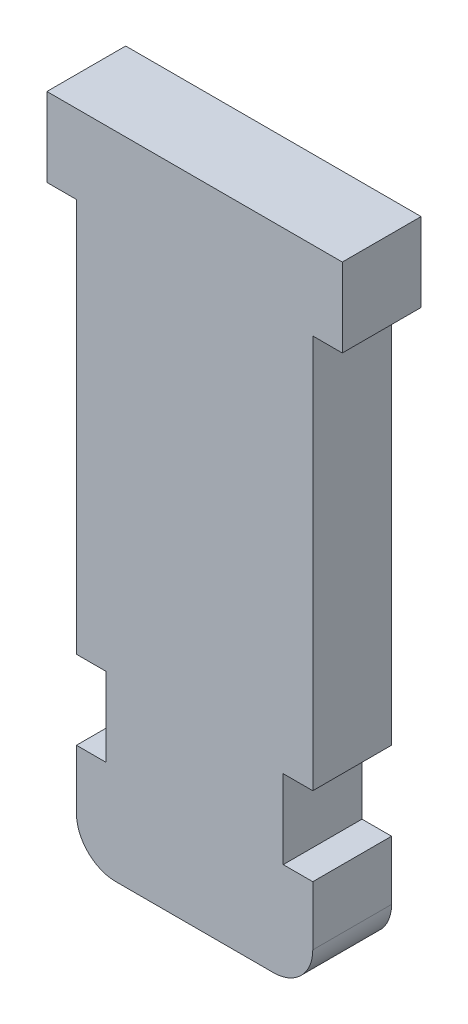
ISO-10303-21;
HEADER;
FILE_DESCRIPTION(('STEP AP214'),'2;1');
FILE_NAME('part.step','',(''),(''),'','','');
FILE_SCHEMA(('AUTOMOTIVE_DESIGN { 1 0 10303 214 1 1 1 1 }'));
ENDSEC;
DATA;
#1=APPLICATION_CONTEXT('core data for automotive mechanical design processes');
#2=APPLICATION_PROTOCOL_DEFINITION('international standard','automotive_design',2000,#1);
#3=PRODUCT_CONTEXT('',#1,'mechanical');
#4=PRODUCT('Part','Part','',(#3));
#5=PRODUCT_RELATED_PRODUCT_CATEGORY('part','',(#4));
#6=PRODUCT_DEFINITION_FORMATION('','',#4);
#7=PRODUCT_DEFINITION_CONTEXT('part definition',#1,'design');
#8=PRODUCT_DEFINITION('design','',#6,#7);
#9=PRODUCT_DEFINITION_SHAPE('','',#8);
#10=(LENGTH_UNIT() NAMED_UNIT(*) SI_UNIT(.MILLI.,.METRE.));
#11=(NAMED_UNIT(*) PLANE_ANGLE_UNIT() SI_UNIT($,.RADIAN.));
#12=(NAMED_UNIT(*) SI_UNIT($,.STERADIAN.) SOLID_ANGLE_UNIT());
#13=UNCERTAINTY_MEASURE_WITH_UNIT(LENGTH_MEASURE(1.E-05),#10,'distance_accuracy_value','');
#14=(GEOMETRIC_REPRESENTATION_CONTEXT(3) GLOBAL_UNCERTAINTY_ASSIGNED_CONTEXT((#13)) GLOBAL_UNIT_ASSIGNED_CONTEXT((#10,
#11,#12)) REPRESENTATION_CONTEXT('',''));
#15=CARTESIAN_POINT('',(0.,0.,0.));
#16=DIRECTION('',(0.,0.,1.));
#17=DIRECTION('',(1.,0.,0.));
#18=AXIS2_PLACEMENT_3D('',#15,#16,#17);
#19=CARTESIAN_POINT('',(-6.,0.,4.));
#20=DIRECTION('',(-1.,0.,0.));
#21=DIRECTION('',(0.,-1.,0.));
#22=AXIS2_PLACEMENT_3D('',#19,#20,#21);
#23=PLANE('',#22);
#24=DIRECTION('',(0.,0.,1.));
#25=VECTOR('',#24,1.);
#26=CARTESIAN_POINT('',(-6.,-22.,0.));
#27=LINE('',#26,#25);
#28=CARTESIAN_POINT('',(-6.,-22.,0.));
#29=VERTEX_POINT('',#28);
#30=CARTESIAN_POINT('',(-6.,-22.,4.));
#31=VERTEX_POINT('',#30);
#32=EDGE_CURVE('E366',#29,#31,#27,.T.);
#33=ORIENTED_EDGE('',*,*,#32,.T.);
#34=DIRECTION('',(0.,1.,0.));
#35=VECTOR('',#34,1.);
#36=CARTESIAN_POINT('',(-6.,0.,4.));
#37=LINE('',#36,#35);
#38=CARTESIAN_POINT('',(-6.,-2.,4.));
#39=VERTEX_POINT('',#38);
#40=EDGE_CURVE('E222',#31,#39,#37,.T.);
#41=ORIENTED_EDGE('',*,*,#40,.T.);
#42=DIRECTION('',(0.,0.,-1.));
#43=VECTOR('',#42,1.);
#44=CARTESIAN_POINT('',(-6.,-2.,4.));
#45=LINE('',#44,#43);
#46=CARTESIAN_POINT('',(-6.,-2.,0.));
#47=VERTEX_POINT('',#46);
#48=EDGE_CURVE('E254',#39,#47,#45,.T.);
#49=ORIENTED_EDGE('',*,*,#48,.T.);
#50=DIRECTION('',(0.,1.,0.));
#51=VECTOR('',#50,1.);
#52=CARTESIAN_POINT('',(-6.,0.,0.));
#53=LINE('',#52,#51);
#54=EDGE_CURVE('E169',#29,#47,#53,.T.);
#55=ORIENTED_EDGE('',*,*,#54,.F.);
#56=EDGE_LOOP('',(#33,#41,#49,#55));
#57=FACE_BOUND('',#56,.T.);
#58=ADVANCED_FACE('F35',(#57),#23,.T.);
#59=CARTESIAN_POINT('',(6.,0.,4.));
#60=DIRECTION('',(-1.,0.,0.));
#61=DIRECTION('',(0.,-1.,0.));
#62=AXIS2_PLACEMENT_3D('',#59,#60,#61);
#63=PLANE('',#62);
#64=DIRECTION('',(0.,1.,0.));
#65=VECTOR('',#64,1.);
#66=CARTESIAN_POINT('',(6.,0.,4.));
#67=LINE('',#66,#65);
#68=CARTESIAN_POINT('',(6.00000000000001,-22.,4.));
#69=VERTEX_POINT('',#68);
#70=CARTESIAN_POINT('',(6.,-2.,4.));
#71=VERTEX_POINT('',#70);
#72=EDGE_CURVE('E224',#69,#71,#67,.T.);
#73=ORIENTED_EDGE('',*,*,#72,.F.);
#74=DIRECTION('',(0.,0.,1.));
#75=VECTOR('',#74,1.);
#76=CARTESIAN_POINT('',(6.00000000000001,-22.,0.));
#77=LINE('',#76,#75);
#78=CARTESIAN_POINT('',(6.00000000000001,-22.,0.));
#79=VERTEX_POINT('',#78);
#80=EDGE_CURVE('E211',#79,#69,#77,.T.);
#81=ORIENTED_EDGE('',*,*,#80,.F.);
#82=DIRECTION('',(0.,1.,0.));
#83=VECTOR('',#82,1.);
#84=CARTESIAN_POINT('',(6.,0.,0.));
#85=LINE('',#84,#83);
#86=CARTESIAN_POINT('',(6.,-2.,0.));
#87=VERTEX_POINT('',#86);
#88=EDGE_CURVE('E239',#79,#87,#85,.T.);
#89=ORIENTED_EDGE('',*,*,#88,.T.);
#90=DIRECTION('',(0.,0.,-1.));
#91=VECTOR('',#90,1.);
#92=CARTESIAN_POINT('',(6.,-2.,4.));
#93=LINE('',#92,#91);
#94=EDGE_CURVE('E266',#71,#87,#93,.T.);
#95=ORIENTED_EDGE('',*,*,#94,.F.);
#96=EDGE_LOOP('',(#73,#81,#89,#95));
#97=FACE_BOUND('',#96,.T.);
#98=ADVANCED_FACE('F301',(#97),#63,.F.);
#99=CARTESIAN_POINT('',(-6.,-29.,0.));
#100=VERTEX_POINT('',#99);
#101=CARTESIAN_POINT('',(-6.,-26.,0.));
#102=VERTEX_POINT('',#101);
#103=EDGE_CURVE('E159',#100,#102,#53,.T.);
#104=ORIENTED_EDGE('',*,*,#103,.F.);
#105=DIRECTION('',(0.,0.,-1.));
#106=VECTOR('',#105,1.);
#107=CARTESIAN_POINT('',(-6.,-29.,4.));
#108=LINE('',#107,#106);
#109=CARTESIAN_POINT('',(-6.,-29.,4.));
#110=VERTEX_POINT('',#109);
#111=EDGE_CURVE('E11',#100,#110,#108,.F.);
#112=ORIENTED_EDGE('',*,*,#111,.T.);
#113=CARTESIAN_POINT('',(-6.,-26.,4.));
#114=VERTEX_POINT('',#113);
#115=EDGE_CURVE('E183',#110,#114,#37,.T.);
#116=ORIENTED_EDGE('',*,*,#115,.T.);
#117=DIRECTION('',(0.,0.,1.));
#118=VECTOR('',#117,1.);
#119=CARTESIAN_POINT('',(-6.,-26.,0.));
#120=LINE('',#119,#118);
#121=EDGE_CURVE('E176',#102,#114,#120,.T.);
#122=ORIENTED_EDGE('',*,*,#121,.F.);
#123=EDGE_LOOP('',(#104,#112,#116,#122));
#124=FACE_BOUND('',#123,.T.);
#125=ADVANCED_FACE('F182',(#124),#23,.T.);
#126=CARTESIAN_POINT('',(0.,-31.,4.));
#127=DIRECTION('',(0.,-1.,0.));
#128=DIRECTION('',(0.,0.,-1.));
#129=AXIS2_PLACEMENT_3D('',#126,#127,#128);
#130=PLANE('',#129);
#131=DIRECTION('',(-1.,0.,0.));
#132=VECTOR('',#131,1.);
#133=CARTESIAN_POINT('',(0.,-31.,0.));
#134=LINE('',#133,#132);
#135=CARTESIAN_POINT('',(4.,-31.,0.));
#136=VERTEX_POINT('',#135);
#137=CARTESIAN_POINT('',(-4.,-31.,0.));
#138=VERTEX_POINT('',#137);
#139=EDGE_CURVE('E168',#136,#138,#134,.T.);
#140=ORIENTED_EDGE('',*,*,#139,.F.);
#141=DIRECTION('',(0.,0.,-1.));
#142=VECTOR('',#141,1.);
#143=CARTESIAN_POINT('',(4.,-31.,4.));
#144=LINE('',#143,#142);
#145=CARTESIAN_POINT('',(4.,-31.,4.));
#146=VERTEX_POINT('',#145);
#147=EDGE_CURVE('E278',#136,#146,#144,.F.);
#148=ORIENTED_EDGE('',*,*,#147,.T.);
#149=DIRECTION('',(-1.,0.,0.));
#150=VECTOR('',#149,1.);
#151=CARTESIAN_POINT('',(0.,-31.,4.));
#152=LINE('',#151,#150);
#153=CARTESIAN_POINT('',(-4.,-31.,4.));
#154=VERTEX_POINT('',#153);
#155=EDGE_CURVE('E221',#146,#154,#152,.T.);
#156=ORIENTED_EDGE('',*,*,#155,.T.);
#157=DIRECTION('',(0.,0.,-1.));
#158=VECTOR('',#157,1.);
#159=CARTESIAN_POINT('',(-4.,-31.,4.));
#160=LINE('',#159,#158);
#161=EDGE_CURVE('E275',#154,#138,#160,.T.);
#162=ORIENTED_EDGE('',*,*,#161,.T.);
#163=EDGE_LOOP('',(#140,#148,#156,#162));
#164=FACE_BOUND('',#163,.T.);
#165=ADVANCED_FACE('F293',(#164),#130,.T.);
#166=CARTESIAN_POINT('',(6.,-29.,4.));
#167=VERTEX_POINT('',#166);
#168=CARTESIAN_POINT('',(6.00000000000001,-26.,4.));
#169=VERTEX_POINT('',#168);
#170=EDGE_CURVE('E225',#167,#169,#67,.T.);
#171=ORIENTED_EDGE('',*,*,#170,.F.);
#172=DIRECTION('',(0.,0.,-1.));
#173=VECTOR('',#172,1.);
#174=CARTESIAN_POINT('',(6.,-29.,0.));
#175=LINE('',#174,#173);
#176=CARTESIAN_POINT('',(6.,-29.,0.));
#177=VERTEX_POINT('',#176);
#178=EDGE_CURVE('E269',#167,#177,#175,.T.);
#179=ORIENTED_EDGE('',*,*,#178,.T.);
#180=CARTESIAN_POINT('',(6.00000000000001,-26.,0.));
#181=VERTEX_POINT('',#180);
#182=EDGE_CURVE('E240',#177,#181,#85,.T.);
#183=ORIENTED_EDGE('',*,*,#182,.T.);
#184=DIRECTION('',(0.,0.,1.));
#185=VECTOR('',#184,1.);
#186=CARTESIAN_POINT('',(6.00000000000001,-26.,0.));
#187=LINE('',#186,#185);
#188=EDGE_CURVE('E214',#181,#169,#187,.T.);
#189=ORIENTED_EDGE('',*,*,#188,.T.);
#190=EDGE_LOOP('',(#171,#179,#183,#189));
#191=FACE_BOUND('',#190,.T.);
#192=ADVANCED_FACE('F288',(#191),#63,.F.);
#193=CARTESIAN_POINT('',(0.,-2.,4.));
#194=DIRECTION('',(0.,-1.,0.));
#195=DIRECTION('',(1.,0.,0.));
#196=AXIS2_PLACEMENT_3D('',#193,#194,#195);
#197=PLANE('',#196);
#198=DIRECTION('',(-1.,0.,0.));
#199=VECTOR('',#198,1.);
#200=CARTESIAN_POINT('',(0.,-2.,0.));
#201=LINE('',#200,#199);
#202=CARTESIAN_POINT('',(7.5,-2.,0.));
#203=VERTEX_POINT('',#202);
#204=EDGE_CURVE('E242',#203,#87,#201,.T.);
#205=ORIENTED_EDGE('',*,*,#204,.F.);
#206=DIRECTION('',(0.,0.,-1.));
#207=VECTOR('',#206,1.);
#208=CARTESIAN_POINT('',(7.5,-2.,4.));
#209=LINE('',#208,#207);
#210=CARTESIAN_POINT('',(7.5,-2.,4.));
#211=VERTEX_POINT('',#210);
#212=EDGE_CURVE('E264',#211,#203,#209,.T.);
#213=ORIENTED_EDGE('',*,*,#212,.F.);
#214=DIRECTION('',(-1.,0.,0.));
#215=VECTOR('',#214,1.);
#216=CARTESIAN_POINT('',(0.,-2.,4.));
#217=LINE('',#216,#215);
#218=EDGE_CURVE('E227',#211,#71,#217,.T.);
#219=ORIENTED_EDGE('',*,*,#218,.T.);
#220=ORIENTED_EDGE('',*,*,#94,.T.);
#221=EDGE_LOOP('',(#205,#213,#219,#220));
#222=FACE_BOUND('',#221,.T.);
#223=ADVANCED_FACE('F319',(#222),#197,.T.);
#224=CARTESIAN_POINT('',(7.5,0.,4.));
#225=DIRECTION('',(-1.,0.,0.));
#226=DIRECTION('',(0.,0.,1.));
#227=AXIS2_PLACEMENT_3D('',#224,#225,#226);
#228=PLANE('',#227);
#229=DIRECTION('',(0.,1.,0.));
#230=VECTOR('',#229,1.);
#231=CARTESIAN_POINT('',(7.5,0.,0.));
#232=LINE('',#231,#230);
#233=CARTESIAN_POINT('',(7.5,2.,0.));
#234=VERTEX_POINT('',#233);
#235=EDGE_CURVE('E245',#203,#234,#232,.T.);
#236=ORIENTED_EDGE('',*,*,#235,.T.);
#237=DIRECTION('',(0.,0.,-1.));
#238=VECTOR('',#237,1.);
#239=CARTESIAN_POINT('',(7.5,2.,4.));
#240=LINE('',#239,#238);
#241=CARTESIAN_POINT('',(7.5,2.,4.));
#242=VERTEX_POINT('',#241);
#243=EDGE_CURVE('E261',#242,#234,#240,.T.);
#244=ORIENTED_EDGE('',*,*,#243,.F.);
#245=DIRECTION('',(0.,1.,0.));
#246=VECTOR('',#245,1.);
#247=CARTESIAN_POINT('',(7.5,0.,4.));
#248=LINE('',#247,#246);
#249=EDGE_CURVE('E230',#211,#242,#248,.T.);
#250=ORIENTED_EDGE('',*,*,#249,.F.);
#251=ORIENTED_EDGE('',*,*,#212,.T.);
#252=EDGE_LOOP('',(#236,#244,#250,#251));
#253=FACE_BOUND('',#252,.T.);
#254=ADVANCED_FACE('F321',(#253),#228,.F.);
#255=CARTESIAN_POINT('',(0.,2.,4.));
#256=DIRECTION('',(0.,-1.,0.));
#257=DIRECTION('',(1.,0.,0.));
#258=AXIS2_PLACEMENT_3D('',#255,#256,#257);
#259=PLANE('',#258);
#260=DIRECTION('',(-1.,0.,0.));
#261=VECTOR('',#260,1.);
#262=CARTESIAN_POINT('',(0.,2.,0.));
#263=LINE('',#262,#261);
#264=CARTESIAN_POINT('',(-7.5,2.,0.));
#265=VERTEX_POINT('',#264);
#266=EDGE_CURVE('E248',#234,#265,#263,.T.);
#267=ORIENTED_EDGE('',*,*,#266,.T.);
#268=DIRECTION('',(0.,0.,-1.));
#269=VECTOR('',#268,1.);
#270=CARTESIAN_POINT('',(-7.5,2.,4.));
#271=LINE('',#270,#269);
#272=CARTESIAN_POINT('',(-7.5,2.,4.));
#273=VERTEX_POINT('',#272);
#274=EDGE_CURVE('E259',#273,#265,#271,.T.);
#275=ORIENTED_EDGE('',*,*,#274,.F.);
#276=DIRECTION('',(-1.,0.,0.));
#277=VECTOR('',#276,1.);
#278=CARTESIAN_POINT('',(0.,2.,4.));
#279=LINE('',#278,#277);
#280=EDGE_CURVE('E233',#242,#273,#279,.T.);
#281=ORIENTED_EDGE('',*,*,#280,.F.);
#282=ORIENTED_EDGE('',*,*,#243,.T.);
#283=EDGE_LOOP('',(#267,#275,#281,#282));
#284=FACE_BOUND('',#283,.T.);
#285=ADVANCED_FACE('F324',(#284),#259,.F.);
#286=CARTESIAN_POINT('',(-7.5,0.,4.));
#287=DIRECTION('',(-1.,0.,0.));
#288=DIRECTION('',(0.,0.,1.));
#289=AXIS2_PLACEMENT_3D('',#286,#287,#288);
#290=PLANE('',#289);
#291=DIRECTION('',(0.,1.,0.));
#292=VECTOR('',#291,1.);
#293=CARTESIAN_POINT('',(-7.5,0.,0.));
#294=LINE('',#293,#292);
#295=CARTESIAN_POINT('',(-7.5,-2.,0.));
#296=VERTEX_POINT('',#295);
#297=EDGE_CURVE('E251',#296,#265,#294,.T.);
#298=ORIENTED_EDGE('',*,*,#297,.F.);
#299=DIRECTION('',(0.,0.,-1.));
#300=VECTOR('',#299,1.);
#301=CARTESIAN_POINT('',(-7.5,-2.,4.));
#302=LINE('',#301,#300);
#303=CARTESIAN_POINT('',(-7.5,-2.,4.));
#304=VERTEX_POINT('',#303);
#305=EDGE_CURVE('E257',#304,#296,#302,.T.);
#306=ORIENTED_EDGE('',*,*,#305,.F.);
#307=DIRECTION('',(0.,1.,0.));
#308=VECTOR('',#307,1.);
#309=CARTESIAN_POINT('',(-7.5,0.,4.));
#310=LINE('',#309,#308);
#311=EDGE_CURVE('E235',#304,#273,#310,.T.);
#312=ORIENTED_EDGE('',*,*,#311,.T.);
#313=ORIENTED_EDGE('',*,*,#274,.T.);
#314=EDGE_LOOP('',(#298,#306,#312,#313));
#315=FACE_BOUND('',#314,.T.);
#316=ADVANCED_FACE('F328',(#315),#290,.T.);
#317=EDGE_CURVE('E246',#47,#296,#201,.T.);
#318=ORIENTED_EDGE('',*,*,#317,.F.);
#319=ORIENTED_EDGE('',*,*,#48,.F.);
#320=EDGE_CURVE('E231',#39,#304,#217,.T.);
#321=ORIENTED_EDGE('',*,*,#320,.T.);
#322=ORIENTED_EDGE('',*,*,#305,.T.);
#323=EDGE_LOOP('',(#318,#319,#321,#322));
#324=FACE_BOUND('',#323,.T.);
#325=ADVANCED_FACE('F332',(#324),#197,.T.);
#326=CARTESIAN_POINT('',(0.,0.,4.));
#327=DIRECTION('',(0.,0.,1.));
#328=DIRECTION('',(1.,0.,0.));
#329=AXIS2_PLACEMENT_3D('',#326,#327,#328);
#330=PLANE('',#329);
#331=ORIENTED_EDGE('',*,*,#155,.F.);
#332=CARTESIAN_POINT('',(4.,-29.,4.));
#333=DIRECTION('',(0.,0.,1.));
#334=DIRECTION('',(1.,0.,0.));
#335=AXIS2_PLACEMENT_3D('',#332,#333,#334);
#336=CIRCLE('',#335,2.);
#337=EDGE_CURVE('E43',#146,#167,#336,.T.);
#338=ORIENTED_EDGE('',*,*,#337,.T.);
#339=ORIENTED_EDGE('',*,*,#170,.T.);
#340=DIRECTION('',(1.,0.,0.));
#341=VECTOR('',#340,1.);
#342=CARTESIAN_POINT('',(6.00000000000001,-26.,4.));
#343=LINE('',#342,#341);
#344=CARTESIAN_POINT('',(4.50000000000001,-26.,4.));
#345=VERTEX_POINT('',#344);
#346=EDGE_CURVE('E196',#345,#169,#343,.T.);
#347=ORIENTED_EDGE('',*,*,#346,.F.);
#348=DIRECTION('',(0.,-1.,0.));
#349=VECTOR('',#348,1.);
#350=CARTESIAN_POINT('',(4.50000000000001,-22.,4.));
#351=LINE('',#350,#349);
#352=CARTESIAN_POINT('',(4.50000000000001,-22.,4.));
#353=VERTEX_POINT('',#352);
#354=EDGE_CURVE('E206',#353,#345,#351,.T.);
#355=ORIENTED_EDGE('',*,*,#354,.F.);
#356=DIRECTION('',(-1.,0.,0.));
#357=VECTOR('',#356,1.);
#358=CARTESIAN_POINT('',(6.00000000000001,-22.,4.));
#359=LINE('',#358,#357);
#360=EDGE_CURVE('E203',#69,#353,#359,.T.);
#361=ORIENTED_EDGE('',*,*,#360,.F.);
#362=ORIENTED_EDGE('',*,*,#72,.T.);
#363=ORIENTED_EDGE('',*,*,#218,.F.);
#364=ORIENTED_EDGE('',*,*,#249,.T.);
#365=ORIENTED_EDGE('',*,*,#280,.T.);
#366=ORIENTED_EDGE('',*,*,#311,.F.);
#367=ORIENTED_EDGE('',*,*,#320,.F.);
#368=ORIENTED_EDGE('',*,*,#40,.F.);
#369=DIRECTION('',(-1.,0.,0.));
#370=VECTOR('',#369,1.);
#371=CARTESIAN_POINT('',(-6.,-22.,4.));
#372=LINE('',#371,#370);
#373=CARTESIAN_POINT('',(-4.5,-22.,4.));
#374=VERTEX_POINT('',#373);
#375=EDGE_CURVE('E180',#374,#31,#372,.T.);
#376=ORIENTED_EDGE('',*,*,#375,.F.);
#377=DIRECTION('',(0.,1.,0.));
#378=VECTOR('',#377,1.);
#379=CARTESIAN_POINT('',(-4.5,-22.,4.));
#380=LINE('',#379,#378);
#381=CARTESIAN_POINT('',(-4.5,-26.,4.));
#382=VERTEX_POINT('',#381);
#383=EDGE_CURVE('E370',#382,#374,#380,.T.);
#384=ORIENTED_EDGE('',*,*,#383,.F.);
#385=DIRECTION('',(1.,0.,0.));
#386=VECTOR('',#385,1.);
#387=CARTESIAN_POINT('',(-6.,-26.,4.));
#388=LINE('',#387,#386);
#389=EDGE_CURVE('E213',#114,#382,#388,.T.);
#390=ORIENTED_EDGE('',*,*,#389,.F.);
#391=ORIENTED_EDGE('',*,*,#115,.F.);
#392=CARTESIAN_POINT('',(-4.,-29.,4.));
#393=DIRECTION('',(0.,0.,1.));
#394=DIRECTION('',(1.,0.,0.));
#395=AXIS2_PLACEMENT_3D('',#392,#393,#394);
#396=CIRCLE('',#395,2.);
#397=EDGE_CURVE('E55',#110,#154,#396,.T.);
#398=ORIENTED_EDGE('',*,*,#397,.T.);
#399=EDGE_LOOP('',(#331,#338,#339,#347,#355,#361,#362,#363,#364,#365,#366,#367,#368,#376,#384,
#390,#391,#398));
#400=FACE_BOUND('',#399,.T.);
#401=ADVANCED_FACE('F282',(#400),#330,.T.);
#402=CARTESIAN_POINT('',(0.,0.,0.));
#403=DIRECTION('',(0.,0.,1.));
#404=DIRECTION('',(1.,0.,0.));
#405=AXIS2_PLACEMENT_3D('',#402,#403,#404);
#406=PLANE('',#405);
#407=ORIENTED_EDGE('',*,*,#182,.F.);
#408=CARTESIAN_POINT('',(4.,-29.,0.));
#409=DIRECTION('',(0.,0.,1.));
#410=DIRECTION('',(1.,0.,0.));
#411=AXIS2_PLACEMENT_3D('',#408,#409,#410);
#412=CIRCLE('',#411,2.);
#413=EDGE_CURVE('E273',#177,#136,#412,.F.);
#414=ORIENTED_EDGE('',*,*,#413,.T.);
#415=ORIENTED_EDGE('',*,*,#139,.T.);
#416=CARTESIAN_POINT('',(-4.,-29.,0.));
#417=DIRECTION('',(0.,0.,1.));
#418=DIRECTION('',(1.,0.,0.));
#419=AXIS2_PLACEMENT_3D('',#416,#417,#418);
#420=CIRCLE('',#419,2.);
#421=EDGE_CURVE('E166',#138,#100,#420,.F.);
#422=ORIENTED_EDGE('',*,*,#421,.T.);
#423=ORIENTED_EDGE('',*,*,#103,.T.);
#424=DIRECTION('',(1.,0.,0.));
#425=VECTOR('',#424,1.);
#426=CARTESIAN_POINT('',(-6.,-26.,0.));
#427=LINE('',#426,#425);
#428=CARTESIAN_POINT('',(-4.5,-26.,0.));
#429=VERTEX_POINT('',#428);
#430=EDGE_CURVE('E164',#102,#429,#427,.T.);
#431=ORIENTED_EDGE('',*,*,#430,.T.);
#432=DIRECTION('',(0.,1.,0.));
#433=VECTOR('',#432,1.);
#434=CARTESIAN_POINT('',(-4.5,-22.,0.));
#435=LINE('',#434,#433);
#436=CARTESIAN_POINT('',(-4.5,-22.,0.));
#437=VERTEX_POINT('',#436);
#438=EDGE_CURVE('E179',#429,#437,#435,.T.);
#439=ORIENTED_EDGE('',*,*,#438,.T.);
#440=DIRECTION('',(-1.,0.,0.));
#441=VECTOR('',#440,1.);
#442=CARTESIAN_POINT('',(-6.,-22.,0.));
#443=LINE('',#442,#441);
#444=EDGE_CURVE('E184',#437,#29,#443,.T.);
#445=ORIENTED_EDGE('',*,*,#444,.T.);
#446=ORIENTED_EDGE('',*,*,#54,.T.);
#447=ORIENTED_EDGE('',*,*,#317,.T.);
#448=ORIENTED_EDGE('',*,*,#297,.T.);
#449=ORIENTED_EDGE('',*,*,#266,.F.);
#450=ORIENTED_EDGE('',*,*,#235,.F.);
#451=ORIENTED_EDGE('',*,*,#204,.T.);
#452=ORIENTED_EDGE('',*,*,#88,.F.);
#453=DIRECTION('',(-1.,0.,0.));
#454=VECTOR('',#453,1.);
#455=CARTESIAN_POINT('',(6.00000000000001,-22.,0.));
#456=LINE('',#455,#454);
#457=CARTESIAN_POINT('',(4.50000000000001,-22.,0.));
#458=VERTEX_POINT('',#457);
#459=EDGE_CURVE('E192',#79,#458,#456,.T.);
#460=ORIENTED_EDGE('',*,*,#459,.T.);
#461=DIRECTION('',(0.,-1.,0.));
#462=VECTOR('',#461,1.);
#463=CARTESIAN_POINT('',(4.50000000000001,-22.,0.));
#464=LINE('',#463,#462);
#465=CARTESIAN_POINT('',(4.50000000000001,-26.,0.));
#466=VERTEX_POINT('',#465);
#467=EDGE_CURVE('E195',#458,#466,#464,.T.);
#468=ORIENTED_EDGE('',*,*,#467,.T.);
#469=DIRECTION('',(1.,0.,0.));
#470=VECTOR('',#469,1.);
#471=CARTESIAN_POINT('',(6.00000000000001,-26.,0.));
#472=LINE('',#471,#470);
#473=EDGE_CURVE('E199',#466,#181,#472,.T.);
#474=ORIENTED_EDGE('',*,*,#473,.T.);
#475=EDGE_LOOP('',(#407,#414,#415,#422,#423,#431,#439,#445,#446,#447,#448,#449,#450,#451,#452,
#460,#468,#474));
#476=FACE_BOUND('',#475,.T.);
#477=ADVANCED_FACE('F162',(#476),#406,.F.);
#478=CARTESIAN_POINT('',(6.00000000000001,-22.,0.));
#479=DIRECTION('',(0.,1.,0.));
#480=DIRECTION('',(-1.,0.,0.));
#481=AXIS2_PLACEMENT_3D('',#478,#479,#480);
#482=PLANE('',#481);
#483=ORIENTED_EDGE('',*,*,#360,.T.);
#484=DIRECTION('',(0.,0.,1.));
#485=VECTOR('',#484,1.);
#486=CARTESIAN_POINT('',(4.50000000000001,-22.,0.));
#487=LINE('',#486,#485);
#488=EDGE_CURVE('E202',#458,#353,#487,.T.);
#489=ORIENTED_EDGE('',*,*,#488,.F.);
#490=ORIENTED_EDGE('',*,*,#459,.F.);
#491=ORIENTED_EDGE('',*,*,#80,.T.);
#492=EDGE_LOOP('',(#483,#489,#490,#491));
#493=FACE_BOUND('',#492,.T.);
#494=ADVANCED_FACE('F339',(#493),#482,.F.);
#495=CARTESIAN_POINT('',(6.00000000000001,-26.,0.));
#496=DIRECTION('',(0.,-1.,0.));
#497=DIRECTION('',(0.,0.,-1.));
#498=AXIS2_PLACEMENT_3D('',#495,#496,#497);
#499=PLANE('',#498);
#500=ORIENTED_EDGE('',*,*,#346,.T.);
#501=ORIENTED_EDGE('',*,*,#188,.F.);
#502=ORIENTED_EDGE('',*,*,#473,.F.);
#503=DIRECTION('',(0.,0.,1.));
#504=VECTOR('',#503,1.);
#505=CARTESIAN_POINT('',(4.50000000000001,-26.,0.));
#506=LINE('',#505,#504);
#507=EDGE_CURVE('E217',#466,#345,#506,.T.);
#508=ORIENTED_EDGE('',*,*,#507,.T.);
#509=EDGE_LOOP('',(#500,#501,#502,#508));
#510=FACE_BOUND('',#509,.T.);
#511=ADVANCED_FACE('F344',(#510),#499,.F.);
#512=CARTESIAN_POINT('',(4.50000000000001,-22.,0.));
#513=DIRECTION('',(-1.,0.,0.));
#514=DIRECTION('',(0.,-1.,0.));
#515=AXIS2_PLACEMENT_3D('',#512,#513,#514);
#516=PLANE('',#515);
#517=ORIENTED_EDGE('',*,*,#354,.T.);
#518=ORIENTED_EDGE('',*,*,#507,.F.);
#519=ORIENTED_EDGE('',*,*,#467,.F.);
#520=ORIENTED_EDGE('',*,*,#488,.T.);
#521=EDGE_LOOP('',(#517,#518,#519,#520));
#522=FACE_BOUND('',#521,.T.);
#523=ADVANCED_FACE('F346',(#522),#516,.F.);
#524=CARTESIAN_POINT('',(-6.,-22.,0.));
#525=DIRECTION('',(0.,1.,0.));
#526=DIRECTION('',(-1.,0.,0.));
#527=AXIS2_PLACEMENT_3D('',#524,#525,#526);
#528=PLANE('',#527);
#529=ORIENTED_EDGE('',*,*,#375,.T.);
#530=ORIENTED_EDGE('',*,*,#32,.F.);
#531=ORIENTED_EDGE('',*,*,#444,.F.);
#532=DIRECTION('',(0.,0.,1.));
#533=VECTOR('',#532,1.);
#534=CARTESIAN_POINT('',(-4.5,-22.,0.));
#535=LINE('',#534,#533);
#536=EDGE_CURVE('E186',#437,#374,#535,.T.);
#537=ORIENTED_EDGE('',*,*,#536,.T.);
#538=EDGE_LOOP('',(#529,#530,#531,#537));
#539=FACE_BOUND('',#538,.T.);
#540=ADVANCED_FACE('F349',(#539),#528,.F.);
#541=CARTESIAN_POINT('',(-4.5,-22.,0.));
#542=DIRECTION('',(1.,0.,0.));
#543=DIRECTION('',(0.,0.,-1.));
#544=AXIS2_PLACEMENT_3D('',#541,#542,#543);
#545=PLANE('',#544);
#546=ORIENTED_EDGE('',*,*,#383,.T.);
#547=ORIENTED_EDGE('',*,*,#536,.F.);
#548=ORIENTED_EDGE('',*,*,#438,.F.);
#549=DIRECTION('',(0.,0.,1.));
#550=VECTOR('',#549,1.);
#551=CARTESIAN_POINT('',(-4.5,-26.,0.));
#552=LINE('',#551,#550);
#553=EDGE_CURVE('E178',#429,#382,#552,.T.);
#554=ORIENTED_EDGE('',*,*,#553,.T.);
#555=EDGE_LOOP('',(#546,#547,#548,#554));
#556=FACE_BOUND('',#555,.T.);
#557=ADVANCED_FACE('F356',(#556),#545,.F.);
#558=CARTESIAN_POINT('',(-6.,-26.,0.));
#559=DIRECTION('',(0.,-1.,0.));
#560=DIRECTION('',(0.,0.,-1.));
#561=AXIS2_PLACEMENT_3D('',#558,#559,#560);
#562=PLANE('',#561);
#563=ORIENTED_EDGE('',*,*,#389,.T.);
#564=ORIENTED_EDGE('',*,*,#553,.F.);
#565=ORIENTED_EDGE('',*,*,#430,.F.);
#566=ORIENTED_EDGE('',*,*,#121,.T.);
#567=EDGE_LOOP('',(#563,#564,#565,#566));
#568=FACE_BOUND('',#567,.T.);
#569=ADVANCED_FACE('F175',(#568),#562,.F.);
#570=CARTESIAN_POINT('',(4.,-29.,4.));
#571=DIRECTION('',(0.,0.,1.));
#572=DIRECTION('',(1.,0.,0.));
#573=AXIS2_PLACEMENT_3D('',#570,#571,#572);
#574=CYLINDRICAL_SURFACE('',#573,2.);
#575=ORIENTED_EDGE('',*,*,#337,.F.);
#576=ORIENTED_EDGE('',*,*,#147,.F.);
#577=ORIENTED_EDGE('',*,*,#413,.F.);
#578=ORIENTED_EDGE('',*,*,#178,.F.);
#579=EDGE_LOOP('',(#575,#576,#577,#578));
#580=FACE_BOUND('',#579,.T.);
#581=ADVANCED_FACE('F290',(#580),#574,.T.);
#582=CARTESIAN_POINT('',(-4.,-29.,4.));
#583=DIRECTION('',(0.,0.,-1.));
#584=DIRECTION('',(-1.,0.,0.));
#585=AXIS2_PLACEMENT_3D('',#582,#583,#584);
#586=CYLINDRICAL_SURFACE('',#585,2.);
#587=ORIENTED_EDGE('',*,*,#397,.F.);
#588=ORIENTED_EDGE('',*,*,#111,.F.);
#589=ORIENTED_EDGE('',*,*,#421,.F.);
#590=ORIENTED_EDGE('',*,*,#161,.F.);
#591=EDGE_LOOP('',(#587,#588,#589,#590));
#592=FACE_BOUND('',#591,.T.);
#593=ADVANCED_FACE('F37',(#592),#586,.T.);
#594=CLOSED_SHELL('',(#58,#98,#125,#165,#192,#223,#254,#285,#316,#325,#401,#477,#494,#511,#523,
#540,#557,#569,#581,#593));
#595=MANIFOLD_SOLID_BREP('B2',#594);
#596=ADVANCED_BREP_SHAPE_REPRESENTATION('',(#18,#595),#14);
#597=SHAPE_DEFINITION_REPRESENTATION(#9,#596);
ENDSEC;
END-ISO-10303-21;
